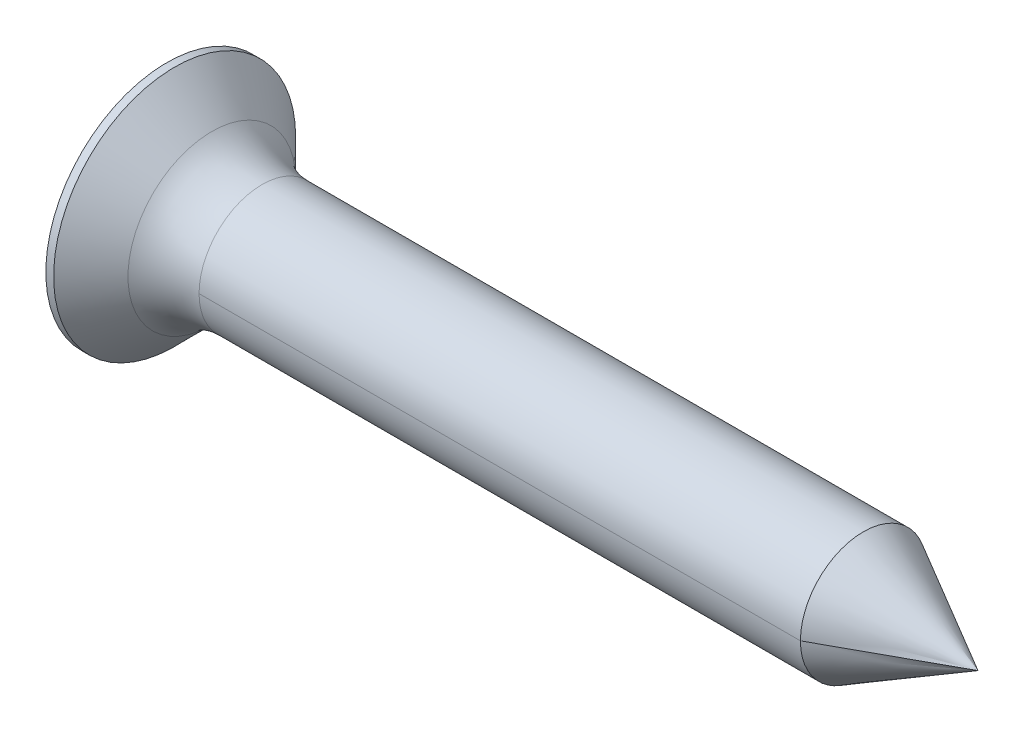
ISO-10303-21;
HEADER;
FILE_DESCRIPTION(('STEP AP214'),'2;1');
FILE_NAME('part.step','',(''),(''),'','','');
FILE_SCHEMA(('AUTOMOTIVE_DESIGN { 1 0 10303 214 1 1 1 1 }'));
ENDSEC;
DATA;
#1=APPLICATION_CONTEXT('core data for automotive mechanical design processes');
#2=APPLICATION_PROTOCOL_DEFINITION('international standard','automotive_design',2000,#1);
#3=PRODUCT_CONTEXT('',#1,'mechanical');
#4=PRODUCT('Part','Part','',(#3));
#5=PRODUCT_RELATED_PRODUCT_CATEGORY('part','',(#4));
#6=PRODUCT_DEFINITION_FORMATION('','',#4);
#7=PRODUCT_DEFINITION_CONTEXT('part definition',#1,'design');
#8=PRODUCT_DEFINITION('design','',#6,#7);
#9=PRODUCT_DEFINITION_SHAPE('','',#8);
#10=(LENGTH_UNIT() NAMED_UNIT(*) SI_UNIT(.MILLI.,.METRE.));
#11=(NAMED_UNIT(*) PLANE_ANGLE_UNIT() SI_UNIT($,.RADIAN.));
#12=(NAMED_UNIT(*) SI_UNIT($,.STERADIAN.) SOLID_ANGLE_UNIT());
#13=UNCERTAINTY_MEASURE_WITH_UNIT(LENGTH_MEASURE(1.E-05),#10,'distance_accuracy_value','');
#14=(GEOMETRIC_REPRESENTATION_CONTEXT(3) GLOBAL_UNCERTAINTY_ASSIGNED_CONTEXT((#13)) GLOBAL_UNIT_ASSIGNED_CONTEXT((#10,
#11,#12)) REPRESENTATION_CONTEXT('',''));
#15=CARTESIAN_POINT('',(0.,0.,0.));
#16=DIRECTION('',(0.,0.,1.));
#17=DIRECTION('',(1.,0.,0.));
#18=AXIS2_PLACEMENT_3D('',#15,#16,#17);
#19=CARTESIAN_POINT('',(0.,0.,-0.7));
#20=DIRECTION('',(0.,0.,-1.));
#21=DIRECTION('',(-1.,0.,0.));
#22=AXIS2_PLACEMENT_3D('',#19,#20,#21);
#23=PLANE('',#22);
#24=DIRECTION('',(1.,0.,0.));
#25=VECTOR('',#24,1.);
#26=CARTESIAN_POINT('',(0.,-0.699999999999998,-0.7));
#27=LINE('',#26,#25);
#28=CARTESIAN_POINT('',(-3.4,-0.699999999999998,-0.7));
#29=VERTEX_POINT('',#28);
#30=CARTESIAN_POINT('',(-0.399999999999999,-0.699999999999998,-0.7));
#31=VERTEX_POINT('',#30);
#32=EDGE_CURVE('E264',#29,#31,#27,.T.);
#33=ORIENTED_EDGE('',*,*,#32,.F.);
#34=DIRECTION('',(0.,-1.,0.));
#35=VECTOR('',#34,1.);
#36=CARTESIAN_POINT('',(-3.4,-3.25,-0.7));
#37=LINE('',#36,#35);
#38=CARTESIAN_POINT('',(-3.4,-3.25,-0.7));
#39=VERTEX_POINT('',#38);
#40=EDGE_CURVE('E177',#29,#39,#37,.T.);
#41=ORIENTED_EDGE('',*,*,#40,.T.);
#42=DIRECTION('',(0.866025403784436,0.500000000000004,0.));
#43=VECTOR('',#42,1.);
#44=CARTESIAN_POINT('',(-0.399999999999999,-1.5179491924311,-0.7));
#45=LINE('',#44,#43);
#46=CARTESIAN_POINT('',(-0.399999999999999,-1.5179491924311,-0.7));
#47=VERTEX_POINT('',#46);
#48=EDGE_CURVE('E249',#39,#47,#45,.T.);
#49=ORIENTED_EDGE('',*,*,#48,.T.);
#50=DIRECTION('',(0.,1.,0.));
#51=VECTOR('',#50,1.);
#52=CARTESIAN_POINT('',(-0.4,1.5179491924311,-0.7));
#53=LINE('',#52,#51);
#54=EDGE_CURVE('E257',#47,#31,#53,.T.);
#55=ORIENTED_EDGE('',*,*,#54,.T.);
#56=EDGE_LOOP('',(#33,#41,#49,#55));
#57=FACE_BOUND('',#56,.T.);
#58=ADVANCED_FACE('F16',(#57),#23,.F.);
#59=CARTESIAN_POINT('',(0.,0.,0.7));
#60=DIRECTION('',(0.,0.,-1.));
#61=DIRECTION('',(-1.,0.,0.));
#62=AXIS2_PLACEMENT_3D('',#59,#60,#61);
#63=PLANE('',#62);
#64=DIRECTION('',(0.,-1.,0.));
#65=VECTOR('',#64,1.);
#66=CARTESIAN_POINT('',(-3.4,-3.25,0.7));
#67=LINE('',#66,#65);
#68=CARTESIAN_POINT('',(-3.4,-0.700000000000002,0.699999999999998));
#69=VERTEX_POINT('',#68);
#70=CARTESIAN_POINT('',(-3.4,-3.25,0.7));
#71=VERTEX_POINT('',#70);
#72=EDGE_CURVE('E164',#69,#71,#67,.T.);
#73=ORIENTED_EDGE('',*,*,#72,.F.);
#74=DIRECTION('',(1.,0.,0.));
#75=VECTOR('',#74,1.);
#76=CARTESIAN_POINT('',(0.,-0.700000000000003,0.7));
#77=LINE('',#76,#75);
#78=CARTESIAN_POINT('',(-0.399999999999999,-0.700000000000003,0.7));
#79=VERTEX_POINT('',#78);
#80=EDGE_CURVE('E24',#69,#79,#77,.T.);
#81=ORIENTED_EDGE('',*,*,#80,.T.);
#82=DIRECTION('',(0.,1.,0.));
#83=VECTOR('',#82,1.);
#84=CARTESIAN_POINT('',(-0.4,1.5179491924311,0.7));
#85=LINE('',#84,#83);
#86=CARTESIAN_POINT('',(-0.399999999999999,-1.5179491924311,0.7));
#87=VERTEX_POINT('',#86);
#88=EDGE_CURVE('E162',#87,#79,#85,.T.);
#89=ORIENTED_EDGE('',*,*,#88,.F.);
#90=DIRECTION('',(0.866025403784436,0.500000000000004,0.));
#91=VECTOR('',#90,1.);
#92=CARTESIAN_POINT('',(-0.399999999999999,-1.5179491924311,0.7));
#93=LINE('',#92,#91);
#94=EDGE_CURVE('E179',#71,#87,#93,.T.);
#95=ORIENTED_EDGE('',*,*,#94,.F.);
#96=EDGE_LOOP('',(#73,#81,#89,#95));
#97=FACE_BOUND('',#96,.T.);
#98=ADVANCED_FACE('F160',(#97),#63,.T.);
#99=CARTESIAN_POINT('',(-3.4,0.,0.));
#100=DIRECTION('',(1.,0.,0.));
#101=DIRECTION('',(0.,0.,-1.));
#102=AXIS2_PLACEMENT_3D('',#99,#100,#101);
#103=PLANE('',#102);
#104=DIRECTION('',(0.,-1.,0.));
#105=VECTOR('',#104,1.);
#106=CARTESIAN_POINT('',(-3.4,0.700000000000011,-3.25));
#107=LINE('',#106,#105);
#108=CARTESIAN_POINT('',(-3.4,0.700000000000011,-3.25));
#109=VERTEX_POINT('',#108);
#110=CARTESIAN_POINT('',(-3.4,-0.699999999999989,-3.25));
#111=VERTEX_POINT('',#110);
#112=EDGE_CURVE('E272',#109,#111,#107,.T.);
#113=ORIENTED_EDGE('',*,*,#112,.F.);
#114=DIRECTION('',(0.,0.,-1.));
#115=VECTOR('',#114,1.);
#116=CARTESIAN_POINT('',(-3.4,0.700000000000011,-3.25));
#117=LINE('',#116,#115);
#118=CARTESIAN_POINT('',(-3.4,0.700000000000003,-0.700000000000001));
#119=VERTEX_POINT('',#118);
#120=EDGE_CURVE('E281',#119,#109,#117,.T.);
#121=ORIENTED_EDGE('',*,*,#120,.F.);
#122=CARTESIAN_POINT('',(-3.4,3.25,-0.7));
#123=VERTEX_POINT('',#122);
#124=EDGE_CURVE('E244',#123,#119,#37,.T.);
#125=ORIENTED_EDGE('',*,*,#124,.F.);
#126=DIRECTION('',(0.,0.,1.));
#127=VECTOR('',#126,1.);
#128=CARTESIAN_POINT('',(-3.4,3.25,-0.7));
#129=LINE('',#128,#127);
#130=CARTESIAN_POINT('',(-3.4,3.25,0.7));
#131=VERTEX_POINT('',#130);
#132=EDGE_CURVE('E129',#123,#131,#129,.T.);
#133=ORIENTED_EDGE('',*,*,#132,.T.);
#134=CARTESIAN_POINT('',(-3.4,0.699999999999998,0.699999999999998));
#135=VERTEX_POINT('',#134);
#136=EDGE_CURVE('E260',#131,#135,#67,.T.);
#137=ORIENTED_EDGE('',*,*,#136,.T.);
#138=CARTESIAN_POINT('',(-3.4,0.699999999999989,3.25));
#139=VERTEX_POINT('',#138);
#140=EDGE_CURVE('E297',#139,#135,#117,.T.);
#141=ORIENTED_EDGE('',*,*,#140,.F.);
#142=DIRECTION('',(0.,-1.,0.));
#143=VECTOR('',#142,1.);
#144=CARTESIAN_POINT('',(-3.4,0.699999999999989,3.25));
#145=LINE('',#144,#143);
#146=CARTESIAN_POINT('',(-3.4,-0.700000000000011,3.25));
#147=VERTEX_POINT('',#146);
#148=EDGE_CURVE('E265',#139,#147,#145,.T.);
#149=ORIENTED_EDGE('',*,*,#148,.T.);
#150=DIRECTION('',(0.,0.,-1.));
#151=VECTOR('',#150,1.);
#152=CARTESIAN_POINT('',(-3.4,-0.699999999999989,-3.25));
#153=LINE('',#152,#151);
#154=EDGE_CURVE('E287',#147,#69,#153,.T.);
#155=ORIENTED_EDGE('',*,*,#154,.T.);
#156=ORIENTED_EDGE('',*,*,#72,.T.);
#157=DIRECTION('',(0.,0.,1.));
#158=VECTOR('',#157,1.);
#159=CARTESIAN_POINT('',(-3.4,-3.25,-0.7));
#160=LINE('',#159,#158);
#161=EDGE_CURVE('E189',#39,#71,#160,.T.);
#162=ORIENTED_EDGE('',*,*,#161,.F.);
#163=ORIENTED_EDGE('',*,*,#40,.F.);
#164=EDGE_CURVE('E31',#29,#111,#153,.T.);
#165=ORIENTED_EDGE('',*,*,#164,.T.);
#166=EDGE_LOOP('',(#113,#121,#125,#133,#137,#141,#149,#155,#156,#162,#163,#165));
#167=FACE_BOUND('',#166,.T.);
#168=CARTESIAN_POINT('',(-3.4,0.,0.));
#169=DIRECTION('',(1.,0.,0.));
#170=DIRECTION('',(0.,0.,-1.));
#171=AXIS2_PLACEMENT_3D('',#168,#169,#170);
#172=CIRCLE('',#171,5.2812693837281);
#173=CARTESIAN_POINT('',(-3.4,0.,-5.2812693837281));
#174=VERTEX_POINT('',#173);
#175=EDGE_CURVE('E135',#174,#174,#172,.T.);
#176=ORIENTED_EDGE('',*,*,#175,.F.);
#177=EDGE_LOOP('',(#176));
#178=FACE_BOUND('',#177,.T.);
#179=ADVANCED_FACE('F225',(#167,#178),#103,.F.);
#180=CARTESIAN_POINT('',(32.,0.,0.));
#181=DIRECTION('',(1.,0.,0.));
#182=DIRECTION('',(0.,1.,0.));
#183=AXIS2_PLACEMENT_3D('',#180,#181,#182);
#184=CYLINDRICAL_SURFACE('',#183,5.2812693837281);
#185=ORIENTED_EDGE('',*,*,#175,.T.);
#186=EDGE_LOOP('',(#185));
#187=FACE_BOUND('',#186,.T.);
#188=CARTESIAN_POINT('',(-3.06,0.,0.));
#189=DIRECTION('',(1.,0.,0.));
#190=DIRECTION('',(0.,0.,-1.));
#191=AXIS2_PLACEMENT_3D('',#188,#189,#190);
#192=CIRCLE('',#191,5.2812693837281);
#193=CARTESIAN_POINT('',(-3.06,0.,-5.2812693837281));
#194=VERTEX_POINT('',#193);
#195=EDGE_CURVE('E299',#194,#194,#192,.T.);
#196=ORIENTED_EDGE('',*,*,#195,.F.);
#197=EDGE_LOOP('',(#196));
#198=FACE_BOUND('',#197,.T.);
#199=ADVANCED_FACE('F313',(#187,#198),#184,.T.);
#200=CARTESIAN_POINT('',(-3.4,3.25,-0.7));
#201=DIRECTION('',(0.500000000000004,0.866025403784436,0.));
#202=DIRECTION('',(-0.866025403784436,0.500000000000004,0.));
#203=AXIS2_PLACEMENT_3D('',#200,#201,#202);
#204=PLANE('',#203);
#205=DIRECTION('',(-0.866025403784436,0.500000000000004,0.));
#206=VECTOR('',#205,1.);
#207=CARTESIAN_POINT('',(-3.4,3.25,0.7));
#208=LINE('',#207,#206);
#209=CARTESIAN_POINT('',(-0.4,1.5179491924311,0.7));
#210=VERTEX_POINT('',#209);
#211=EDGE_CURVE('E173',#210,#131,#208,.T.);
#212=ORIENTED_EDGE('',*,*,#211,.T.);
#213=ORIENTED_EDGE('',*,*,#132,.F.);
#214=DIRECTION('',(-0.866025403784436,0.500000000000004,0.));
#215=VECTOR('',#214,1.);
#216=CARTESIAN_POINT('',(-3.4,3.25,-0.7));
#217=LINE('',#216,#215);
#218=CARTESIAN_POINT('',(-0.4,1.5179491924311,-0.7));
#219=VERTEX_POINT('',#218);
#220=EDGE_CURVE('E191',#219,#123,#217,.T.);
#221=ORIENTED_EDGE('',*,*,#220,.F.);
#222=DIRECTION('',(0.,0.,1.));
#223=VECTOR('',#222,1.);
#224=CARTESIAN_POINT('',(-0.4,1.5179491924311,-0.7));
#225=LINE('',#224,#223);
#226=EDGE_CURVE('E185',#219,#210,#225,.T.);
#227=ORIENTED_EDGE('',*,*,#226,.T.);
#228=EDGE_LOOP('',(#212,#213,#221,#227));
#229=FACE_BOUND('',#228,.T.);
#230=ADVANCED_FACE('F315',(#229),#204,.F.);
#231=CARTESIAN_POINT('',(-0.4,1.5179491924311,-0.7));
#232=DIRECTION('',(1.,0.,0.));
#233=DIRECTION('',(0.,1.,0.));
#234=AXIS2_PLACEMENT_3D('',#231,#232,#233);
#235=PLANE('',#234);
#236=CARTESIAN_POINT('',(-0.399999999999999,0.700000000000002,-0.7));
#237=VERTEX_POINT('',#236);
#238=EDGE_CURVE('E252',#237,#219,#53,.T.);
#239=ORIENTED_EDGE('',*,*,#238,.F.);
#240=DIRECTION('',(0.,0.,1.));
#241=VECTOR('',#240,1.);
#242=CARTESIAN_POINT('',(-0.4,0.699999999999995,1.51794919243111));
#243=LINE('',#242,#241);
#244=CARTESIAN_POINT('',(-0.399999999999999,0.700000000000005,-1.5179491924311));
#245=VERTEX_POINT('',#244);
#246=EDGE_CURVE('E291',#245,#237,#243,.T.);
#247=ORIENTED_EDGE('',*,*,#246,.F.);
#248=DIRECTION('',(0.,-1.,0.));
#249=VECTOR('',#248,1.);
#250=CARTESIAN_POINT('',(-0.399999999999999,0.700000000000005,-1.5179491924311));
#251=LINE('',#250,#249);
#252=CARTESIAN_POINT('',(-0.399999999999999,-0.699999999999995,-1.51794919243111));
#253=VERTEX_POINT('',#252);
#254=EDGE_CURVE('E274',#245,#253,#251,.T.);
#255=ORIENTED_EDGE('',*,*,#254,.T.);
#256=DIRECTION('',(0.,0.,1.));
#257=VECTOR('',#256,1.);
#258=CARTESIAN_POINT('',(-0.4,-0.700000000000005,1.5179491924311));
#259=LINE('',#258,#257);
#260=EDGE_CURVE('E282',#253,#31,#259,.T.);
#261=ORIENTED_EDGE('',*,*,#260,.T.);
#262=ORIENTED_EDGE('',*,*,#54,.F.);
#263=DIRECTION('',(0.,0.,1.));
#264=VECTOR('',#263,1.);
#265=CARTESIAN_POINT('',(-0.399999999999999,-1.5179491924311,-0.7));
#266=LINE('',#265,#264);
#267=EDGE_CURVE('E172',#47,#87,#266,.T.);
#268=ORIENTED_EDGE('',*,*,#267,.T.);
#269=ORIENTED_EDGE('',*,*,#88,.T.);
#270=CARTESIAN_POINT('',(-0.4,-0.700000000000005,1.5179491924311));
#271=VERTEX_POINT('',#270);
#272=EDGE_CURVE('E39',#79,#271,#259,.T.);
#273=ORIENTED_EDGE('',*,*,#272,.T.);
#274=DIRECTION('',(0.,-1.,0.));
#275=VECTOR('',#274,1.);
#276=CARTESIAN_POINT('',(-0.4,0.699999999999995,1.51794919243111));
#277=LINE('',#276,#275);
#278=CARTESIAN_POINT('',(-0.4,0.699999999999995,1.51794919243111));
#279=VERTEX_POINT('',#278);
#280=EDGE_CURVE('E269',#279,#271,#277,.T.);
#281=ORIENTED_EDGE('',*,*,#280,.F.);
#282=CARTESIAN_POINT('',(-0.4,0.699999999999998,0.7));
#283=VERTEX_POINT('',#282);
#284=EDGE_CURVE('E293',#283,#279,#243,.T.);
#285=ORIENTED_EDGE('',*,*,#284,.F.);
#286=EDGE_CURVE('E174',#283,#210,#85,.T.);
#287=ORIENTED_EDGE('',*,*,#286,.T.);
#288=ORIENTED_EDGE('',*,*,#226,.F.);
#289=EDGE_LOOP('',(#239,#247,#255,#261,#262,#268,#269,#273,#281,#285,#287,#288));
#290=FACE_BOUND('',#289,.T.);
#291=ADVANCED_FACE('F168',(#290),#235,.F.);
#292=CARTESIAN_POINT('',(-0.399999999999999,-1.5179491924311,-0.7));
#293=DIRECTION('',(0.500000000000004,-0.866025403784436,0.));
#294=DIRECTION('',(0.866025403784436,0.500000000000004,0.));
#295=AXIS2_PLACEMENT_3D('',#292,#293,#294);
#296=PLANE('',#295);
#297=ORIENTED_EDGE('',*,*,#94,.T.);
#298=ORIENTED_EDGE('',*,*,#267,.F.);
#299=ORIENTED_EDGE('',*,*,#48,.F.);
#300=ORIENTED_EDGE('',*,*,#161,.T.);
#301=EDGE_LOOP('',(#297,#298,#299,#300));
#302=FACE_BOUND('',#301,.T.);
#303=ADVANCED_FACE('F230',(#302),#296,.F.);
#304=ORIENTED_EDGE('',*,*,#124,.T.);
#305=DIRECTION('',(1.,0.,0.));
#306=VECTOR('',#305,1.);
#307=CARTESIAN_POINT('',(0.,0.700000000000003,-0.7));
#308=LINE('',#307,#306);
#309=EDGE_CURVE('E245',#119,#237,#308,.T.);
#310=ORIENTED_EDGE('',*,*,#309,.T.);
#311=ORIENTED_EDGE('',*,*,#238,.T.);
#312=ORIENTED_EDGE('',*,*,#220,.T.);
#313=EDGE_LOOP('',(#304,#310,#311,#312));
#314=FACE_BOUND('',#313,.T.);
#315=ADVANCED_FACE('F221',(#314),#23,.F.);
#316=DIRECTION('',(1.,0.,0.));
#317=VECTOR('',#316,1.);
#318=CARTESIAN_POINT('',(0.,0.699999999999998,0.7));
#319=LINE('',#318,#317);
#320=EDGE_CURVE('E11',#135,#283,#319,.T.);
#321=ORIENTED_EDGE('',*,*,#320,.F.);
#322=ORIENTED_EDGE('',*,*,#136,.F.);
#323=ORIENTED_EDGE('',*,*,#211,.F.);
#324=ORIENTED_EDGE('',*,*,#286,.F.);
#325=EDGE_LOOP('',(#321,#322,#323,#324));
#326=FACE_BOUND('',#325,.T.);
#327=ADVANCED_FACE('F227',(#326),#63,.T.);
#328=CARTESIAN_POINT('',(0.,-0.7,0.));
#329=DIRECTION('',(0.,1.,0.));
#330=DIRECTION('',(-1.,0.,0.));
#331=AXIS2_PLACEMENT_3D('',#328,#329,#330);
#332=PLANE('',#331);
#333=ORIENTED_EDGE('',*,*,#154,.F.);
#334=DIRECTION('',(-0.866025403784436,0.,0.500000000000004));
#335=VECTOR('',#334,1.);
#336=CARTESIAN_POINT('',(-3.4,-0.700000000000011,3.25));
#337=LINE('',#336,#335);
#338=EDGE_CURVE('E278',#271,#147,#337,.T.);
#339=ORIENTED_EDGE('',*,*,#338,.F.);
#340=ORIENTED_EDGE('',*,*,#272,.F.);
#341=ORIENTED_EDGE('',*,*,#80,.F.);
#342=EDGE_LOOP('',(#333,#339,#340,#341));
#343=FACE_BOUND('',#342,.T.);
#344=ADVANCED_FACE('F236',(#343),#332,.T.);
#345=CARTESIAN_POINT('',(0.,0.7,0.));
#346=DIRECTION('',(0.,1.,0.));
#347=DIRECTION('',(-1.,0.,0.));
#348=AXIS2_PLACEMENT_3D('',#345,#346,#347);
#349=PLANE('',#348);
#350=ORIENTED_EDGE('',*,*,#320,.T.);
#351=ORIENTED_EDGE('',*,*,#284,.T.);
#352=DIRECTION('',(-0.866025403784436,0.,0.500000000000004));
#353=VECTOR('',#352,1.);
#354=CARTESIAN_POINT('',(-3.4,0.699999999999989,3.25));
#355=LINE('',#354,#353);
#356=EDGE_CURVE('E275',#279,#139,#355,.T.);
#357=ORIENTED_EDGE('',*,*,#356,.T.);
#358=ORIENTED_EDGE('',*,*,#140,.T.);
#359=EDGE_LOOP('',(#350,#351,#357,#358));
#360=FACE_BOUND('',#359,.T.);
#361=ADVANCED_FACE('F363',(#360),#349,.F.);
#362=CARTESIAN_POINT('',(-3.4,0.699999999999989,3.25));
#363=DIRECTION('',(0.500000000000004,0.,0.866025403784436));
#364=DIRECTION('',(0.866025403784436,0.,-0.500000000000004));
#365=AXIS2_PLACEMENT_3D('',#362,#363,#364);
#366=PLANE('',#365);
#367=ORIENTED_EDGE('',*,*,#338,.T.);
#368=ORIENTED_EDGE('',*,*,#148,.F.);
#369=ORIENTED_EDGE('',*,*,#356,.F.);
#370=ORIENTED_EDGE('',*,*,#280,.T.);
#371=EDGE_LOOP('',(#367,#368,#369,#370));
#372=FACE_BOUND('',#371,.T.);
#373=ADVANCED_FACE('F373',(#372),#366,.F.);
#374=ORIENTED_EDGE('',*,*,#120,.T.);
#375=DIRECTION('',(0.866025403784436,0.,0.500000000000004));
#376=VECTOR('',#375,1.);
#377=CARTESIAN_POINT('',(-0.399999999999999,0.700000000000005,-1.5179491924311));
#378=LINE('',#377,#376);
#379=EDGE_CURVE('E294',#109,#245,#378,.T.);
#380=ORIENTED_EDGE('',*,*,#379,.T.);
#381=ORIENTED_EDGE('',*,*,#246,.T.);
#382=ORIENTED_EDGE('',*,*,#309,.F.);
#383=EDGE_LOOP('',(#374,#380,#381,#382));
#384=FACE_BOUND('',#383,.T.);
#385=ADVANCED_FACE('F376',(#384),#349,.F.);
#386=ORIENTED_EDGE('',*,*,#32,.T.);
#387=ORIENTED_EDGE('',*,*,#260,.F.);
#388=DIRECTION('',(0.866025403784436,0.,0.500000000000004));
#389=VECTOR('',#388,1.);
#390=CARTESIAN_POINT('',(-0.399999999999999,-0.699999999999995,-1.51794919243111));
#391=LINE('',#390,#389);
#392=EDGE_CURVE('E284',#111,#253,#391,.T.);
#393=ORIENTED_EDGE('',*,*,#392,.F.);
#394=ORIENTED_EDGE('',*,*,#164,.F.);
#395=EDGE_LOOP('',(#386,#387,#393,#394));
#396=FACE_BOUND('',#395,.T.);
#397=ADVANCED_FACE('F365',(#396),#332,.T.);
#398=CARTESIAN_POINT('',(-0.399999999999999,0.700000000000005,-1.5179491924311));
#399=DIRECTION('',(0.500000000000004,0.,-0.866025403784436));
#400=DIRECTION('',(-0.866025403784436,0.,-0.500000000000004));
#401=AXIS2_PLACEMENT_3D('',#398,#399,#400);
#402=PLANE('',#401);
#403=ORIENTED_EDGE('',*,*,#392,.T.);
#404=ORIENTED_EDGE('',*,*,#254,.F.);
#405=ORIENTED_EDGE('',*,*,#379,.F.);
#406=ORIENTED_EDGE('',*,*,#112,.T.);
#407=EDGE_LOOP('',(#403,#404,#405,#406));
#408=FACE_BOUND('',#407,.T.);
#409=ADVANCED_FACE('F309',(#408),#402,.F.);
#410=CARTESIAN_POINT('',(-3.06,0.,0.));
#411=DIRECTION('',(-1.,0.,0.));
#412=DIRECTION('',(0.,0.,1.));
#413=AXIS2_PLACEMENT_3D('',#410,#411,#412);
#414=CONICAL_SURFACE('',#413,5.2812693837281,0.785398163397443);
#415=CARTESIAN_POINT('',(-1.43717550132996,0.,0.));
#416=DIRECTION('',(1.,0.,0.));
#417=DIRECTION('',(0.,0.,-1.));
#418=AXIS2_PLACEMENT_3D('',#415,#416,#417);
#419=CIRCLE('',#418,3.65844488505808);
#420=CARTESIAN_POINT('',(-1.43717550132996,0.,-3.65844488505808));
#421=VERTEX_POINT('',#420);
#422=EDGE_CURVE('E302',#421,#421,#419,.T.);
#423=ORIENTED_EDGE('',*,*,#422,.F.);
#424=EDGE_LOOP('',(#423));
#425=FACE_BOUND('',#424,.T.);
#426=ORIENTED_EDGE('',*,*,#195,.T.);
#427=EDGE_LOOP('',(#426));
#428=FACE_BOUND('',#427,.T.);
#429=ADVANCED_FACE('F306',(#425,#428),#414,.T.);
#430=CARTESIAN_POINT('',(0.756004460845741,0.,0.));
#431=DIRECTION('',(1.,0.,0.));
#432=DIRECTION('',(0.,0.,-1.));
#433=AXIS2_PLACEMENT_3D('',#430,#431,#432);
#434=TOROIDAL_SURFACE('',#433,5.85162484723381,3.10162484723381);
#435=CARTESIAN_POINT('',(0.756004460845741,0.,0.));
#436=DIRECTION('',(1.,0.,0.));
#437=DIRECTION('',(0.,0.,-1.));
#438=AXIS2_PLACEMENT_3D('',#435,#436,#437);
#439=CIRCLE('',#438,2.75);
#440=CARTESIAN_POINT('',(0.756004460845741,0.,-2.75));
#441=VERTEX_POINT('',#440);
#442=CARTESIAN_POINT('',(0.756004460845741,0.,2.75));
#443=VERTEX_POINT('',#442);
#444=EDGE_CURVE('E119',#441,#443,#439,.T.);
#445=ORIENTED_EDGE('',*,*,#444,.F.);
#446=CARTESIAN_POINT('',(0.756004460845741,0.,0.));
#447=DIRECTION('',(1.,0.,0.));
#448=DIRECTION('',(0.,0.,-1.));
#449=AXIS2_PLACEMENT_3D('',#446,#447,#448);
#450=CIRCLE('',#449,2.75);
#451=EDGE_CURVE('E123',#443,#441,#450,.T.);
#452=ORIENTED_EDGE('',*,*,#451,.F.);
#453=EDGE_LOOP('',(#445,#452));
#454=FACE_BOUND('',#453,.T.);
#455=ORIENTED_EDGE('',*,*,#422,.T.);
#456=EDGE_LOOP('',(#455));
#457=FACE_BOUND('',#456,.T.);
#458=ADVANCED_FACE('F121',(#454,#457),#434,.F.);
#459=CARTESIAN_POINT('',(27.,0.,0.));
#460=DIRECTION('',(-1.,0.,0.));
#461=DIRECTION('',(0.,1.,0.));
#462=AXIS2_PLACEMENT_3D('',#459,#460,#461);
#463=CONICAL_SURFACE('',#462,2.75,0.502843210927861);
#464=DIRECTION('',(-0.876215908676647,0.,0.481918749772156));
#465=VECTOR('',#464,1.);
#466=CARTESIAN_POINT('',(32.,0.,0.));
#467=LINE('',#466,#465);
#468=CARTESIAN_POINT('',(32.,0.,0.));
#469=VERTEX_POINT('',#468);
#470=CARTESIAN_POINT('',(27.,0.,2.75));
#471=VERTEX_POINT('',#470);
#472=EDGE_CURVE('E144',#469,#471,#467,.T.);
#473=ORIENTED_EDGE('',*,*,#472,.T.);
#474=CARTESIAN_POINT('',(27.,0.,0.));
#475=DIRECTION('',(1.,0.,0.));
#476=DIRECTION('',(0.,0.,-1.));
#477=AXIS2_PLACEMENT_3D('',#474,#475,#476);
#478=CIRCLE('',#477,2.75);
#479=CARTESIAN_POINT('',(27.,0.,-2.75));
#480=VERTEX_POINT('',#479);
#481=EDGE_CURVE('E140',#471,#480,#478,.T.);
#482=ORIENTED_EDGE('',*,*,#481,.T.);
#483=DIRECTION('',(-0.876215908676647,0.,-0.481918749772156));
#484=VECTOR('',#483,1.);
#485=CARTESIAN_POINT('',(32.,0.,0.));
#486=LINE('',#485,#484);
#487=EDGE_CURVE('E196',#469,#480,#486,.T.);
#488=ORIENTED_EDGE('',*,*,#487,.F.);
#489=EDGE_LOOP('',(#473,#482,#488));
#490=FACE_BOUND('',#489,.T.);
#491=ADVANCED_FACE('F207',(#490),#463,.T.);
#492=CARTESIAN_POINT('',(27.,0.,0.));
#493=DIRECTION('',(-1.,0.,0.));
#494=DIRECTION('',(0.,-1.,0.));
#495=AXIS2_PLACEMENT_3D('',#492,#493,#494);
#496=CONICAL_SURFACE('',#495,2.75,0.502843210927861);
#497=ORIENTED_EDGE('',*,*,#487,.T.);
#498=CARTESIAN_POINT('',(27.,0.,0.));
#499=DIRECTION('',(1.,0.,0.));
#500=DIRECTION('',(0.,0.,-1.));
#501=AXIS2_PLACEMENT_3D('',#498,#499,#500);
#502=CIRCLE('',#501,2.75);
#503=EDGE_CURVE('E128',#480,#471,#502,.T.);
#504=ORIENTED_EDGE('',*,*,#503,.T.);
#505=ORIENTED_EDGE('',*,*,#472,.F.);
#506=EDGE_LOOP('',(#497,#504,#505));
#507=FACE_BOUND('',#506,.T.);
#508=ADVANCED_FACE('F209',(#507),#496,.T.);
#509=CARTESIAN_POINT('',(32.,0.,0.));
#510=DIRECTION('',(1.,0.,0.));
#511=DIRECTION('',(0.,-1.,0.));
#512=AXIS2_PLACEMENT_3D('',#509,#510,#511);
#513=CYLINDRICAL_SURFACE('',#512,2.75);
#514=DIRECTION('',(1.,0.,0.));
#515=VECTOR('',#514,1.);
#516=CARTESIAN_POINT('',(0.756004460845741,0.,2.75));
#517=LINE('',#516,#515);
#518=EDGE_CURVE('E134',#443,#471,#517,.T.);
#519=ORIENTED_EDGE('',*,*,#518,.T.);
#520=ORIENTED_EDGE('',*,*,#503,.F.);
#521=DIRECTION('',(1.,0.,0.));
#522=VECTOR('',#521,1.);
#523=CARTESIAN_POINT('',(0.756004460845741,0.,-2.75));
#524=LINE('',#523,#522);
#525=EDGE_CURVE('E132',#441,#480,#524,.T.);
#526=ORIENTED_EDGE('',*,*,#525,.F.);
#527=ORIENTED_EDGE('',*,*,#444,.T.);
#528=EDGE_LOOP('',(#519,#520,#526,#527));
#529=FACE_BOUND('',#528,.T.);
#530=ADVANCED_FACE('F137',(#529),#513,.T.);
#531=CARTESIAN_POINT('',(32.,0.,0.));
#532=DIRECTION('',(1.,0.,0.));
#533=DIRECTION('',(0.,1.,0.));
#534=AXIS2_PLACEMENT_3D('',#531,#532,#533);
#535=CYLINDRICAL_SURFACE('',#534,2.75);
#536=ORIENTED_EDGE('',*,*,#518,.F.);
#537=ORIENTED_EDGE('',*,*,#451,.T.);
#538=ORIENTED_EDGE('',*,*,#525,.T.);
#539=ORIENTED_EDGE('',*,*,#481,.F.);
#540=EDGE_LOOP('',(#536,#537,#538,#539));
#541=FACE_BOUND('',#540,.T.);
#542=ADVANCED_FACE('F18',(#541),#535,.T.);
#543=CLOSED_SHELL('',(#58,#98,#179,#199,#230,#291,#303,#315,#327,#344,#361,#373,#385,#397,#409,
#429,#458,#491,#508,#530,#542));
#544=MANIFOLD_SOLID_BREP('B1',#543);
#545=ADVANCED_BREP_SHAPE_REPRESENTATION('',(#18,#544),#14);
#546=SHAPE_DEFINITION_REPRESENTATION(#9,#545);
ENDSEC;
END-ISO-10303-21;
